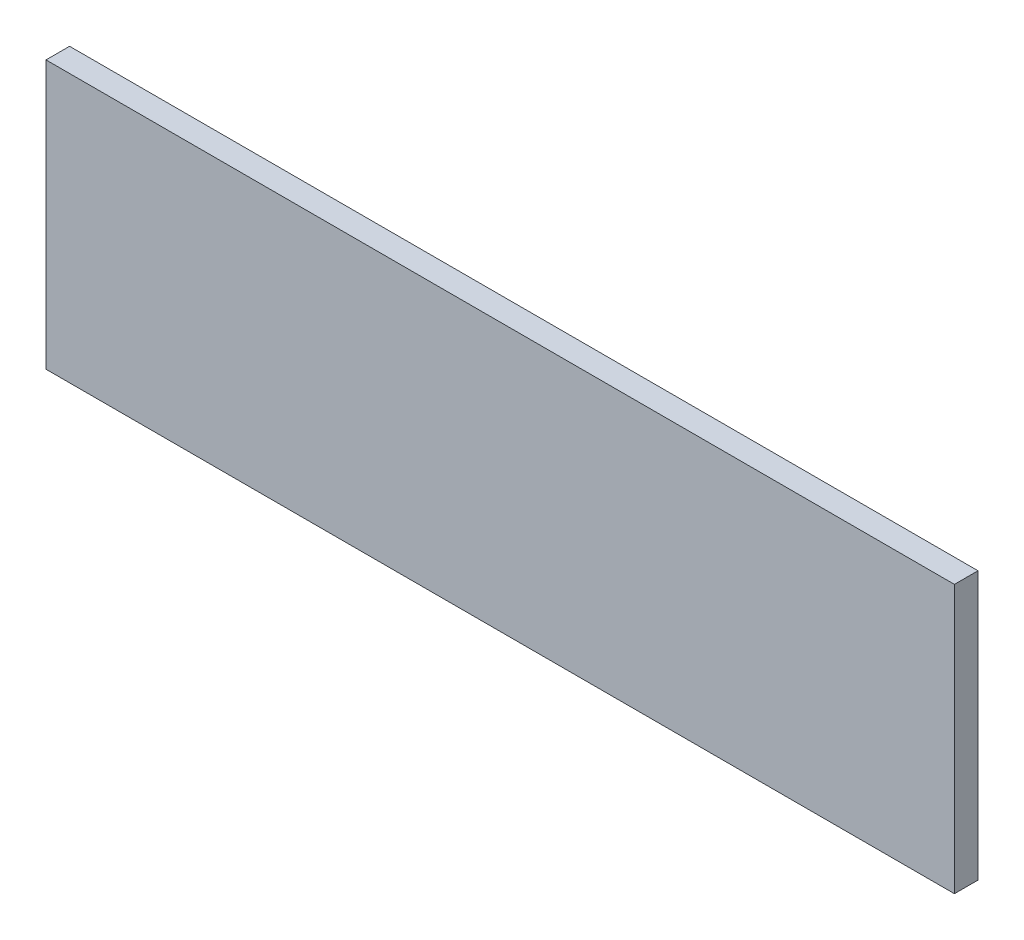
ISO-10303-21;
HEADER;
FILE_DESCRIPTION(('STEP AP214'),'2;1');
FILE_NAME('part.step','',(''),(''),'','','');
FILE_SCHEMA(('AUTOMOTIVE_DESIGN { 1 0 10303 214 1 1 1 1 }'));
ENDSEC;
DATA;
#1=APPLICATION_CONTEXT('core data for automotive mechanical design processes');
#2=APPLICATION_PROTOCOL_DEFINITION('international standard','automotive_design',2000,#1);
#3=PRODUCT_CONTEXT('',#1,'mechanical');
#4=PRODUCT('Part','Part','',(#3));
#5=PRODUCT_RELATED_PRODUCT_CATEGORY('part','',(#4));
#6=PRODUCT_DEFINITION_FORMATION('','',#4);
#7=PRODUCT_DEFINITION_CONTEXT('part definition',#1,'design');
#8=PRODUCT_DEFINITION('design','',#6,#7);
#9=PRODUCT_DEFINITION_SHAPE('','',#8);
#10=(LENGTH_UNIT() NAMED_UNIT(*) SI_UNIT(.MILLI.,.METRE.));
#11=(NAMED_UNIT(*) PLANE_ANGLE_UNIT() SI_UNIT($,.RADIAN.));
#12=(NAMED_UNIT(*) SI_UNIT($,.STERADIAN.) SOLID_ANGLE_UNIT());
#13=UNCERTAINTY_MEASURE_WITH_UNIT(LENGTH_MEASURE(1.E-05),#10,'distance_accuracy_value','');
#14=(GEOMETRIC_REPRESENTATION_CONTEXT(3) GLOBAL_UNCERTAINTY_ASSIGNED_CONTEXT((#13)) GLOBAL_UNIT_ASSIGNED_CONTEXT((#10,
#11,#12)) REPRESENTATION_CONTEXT('',''));
#15=CARTESIAN_POINT('',(0.,0.,0.));
#16=DIRECTION('',(0.,0.,1.));
#17=DIRECTION('',(1.,0.,0.));
#18=AXIS2_PLACEMENT_3D('',#15,#16,#17);
#19=CARTESIAN_POINT('',(2.11916772,-0.62500002,0.10999978));
#20=DIRECTION('',(0.,0.,1.));
#21=DIRECTION('',(1.,0.,0.));
#22=AXIS2_PLACEMENT_3D('',#19,#20,#21);
#23=PLANE('',#22);
#24=DIRECTION('',(0.,-1.,0.));
#25=VECTOR('',#24,1.);
#26=CARTESIAN_POINT('',(2.11916772,0.62500002,0.10999978));
#27=LINE('',#26,#25);
#28=CARTESIAN_POINT('',(2.11916772,0.62500002,0.10999978));
#29=VERTEX_POINT('',#28);
#30=CARTESIAN_POINT('',(2.11916772,-0.62500002,0.10999978));
#31=VERTEX_POINT('',#30);
#32=EDGE_CURVE('E28',#29,#31,#27,.T.);
#33=ORIENTED_EDGE('',*,*,#32,.F.);
#34=DIRECTION('',(1.,0.,0.));
#35=VECTOR('',#34,1.);
#36=CARTESIAN_POINT('',(-2.11916518,0.62500002,0.10999978));
#37=LINE('',#36,#35);
#38=CARTESIAN_POINT('',(-2.11916518,0.62500002,0.10999978));
#39=VERTEX_POINT('',#38);
#40=EDGE_CURVE('E21',#39,#29,#37,.T.);
#41=ORIENTED_EDGE('',*,*,#40,.F.);
#42=DIRECTION('',(0.,1.,0.));
#43=VECTOR('',#42,1.);
#44=CARTESIAN_POINT('',(-2.11916518,-0.62500002,0.10999978));
#45=LINE('',#44,#43);
#46=CARTESIAN_POINT('',(-2.11916518,-0.62500002,0.10999978));
#47=VERTEX_POINT('',#46);
#48=EDGE_CURVE('E59',#47,#39,#45,.T.);
#49=ORIENTED_EDGE('',*,*,#48,.F.);
#50=DIRECTION('',(-1.,0.,0.));
#51=VECTOR('',#50,1.);
#52=CARTESIAN_POINT('',(2.11916772,-0.62500002,0.10999978));
#53=LINE('',#52,#51);
#54=EDGE_CURVE('E111',#31,#47,#53,.T.);
#55=ORIENTED_EDGE('',*,*,#54,.F.);
#56=EDGE_LOOP('',(#33,#41,#49,#55));
#57=FACE_BOUND('',#56,.T.);
#58=ADVANCED_FACE('F17',(#57),#23,.T.);
#59=CARTESIAN_POINT('',(2.11916772,-0.62500002,0.));
#60=DIRECTION('',(0.,0.,1.));
#61=DIRECTION('',(1.,0.,0.));
#62=AXIS2_PLACEMENT_3D('',#59,#60,#61);
#63=PLANE('',#62);
#64=DIRECTION('',(-1.,0.,0.));
#65=VECTOR('',#64,1.);
#66=CARTESIAN_POINT('',(2.11916772,-0.62500002,0.));
#67=LINE('',#66,#65);
#68=CARTESIAN_POINT('',(2.11916772,-0.62500002,0.));
#69=VERTEX_POINT('',#68);
#70=CARTESIAN_POINT('',(-2.11916518,-0.62500002,0.));
#71=VERTEX_POINT('',#70);
#72=EDGE_CURVE('E89',#69,#71,#67,.T.);
#73=ORIENTED_EDGE('',*,*,#72,.T.);
#74=DIRECTION('',(0.,1.,0.));
#75=VECTOR('',#74,1.);
#76=CARTESIAN_POINT('',(-2.11916518,-0.62500002,0.));
#77=LINE('',#76,#75);
#78=CARTESIAN_POINT('',(-2.11916518,0.62500002,0.));
#79=VERTEX_POINT('',#78);
#80=EDGE_CURVE('E86',#71,#79,#77,.T.);
#81=ORIENTED_EDGE('',*,*,#80,.T.);
#82=DIRECTION('',(1.,0.,0.));
#83=VECTOR('',#82,1.);
#84=CARTESIAN_POINT('',(-2.11916518,0.62500002,0.));
#85=LINE('',#84,#83);
#86=CARTESIAN_POINT('',(2.11916772,0.62500002,0.));
#87=VERTEX_POINT('',#86);
#88=EDGE_CURVE('E75',#79,#87,#85,.T.);
#89=ORIENTED_EDGE('',*,*,#88,.T.);
#90=DIRECTION('',(0.,-1.,0.));
#91=VECTOR('',#90,1.);
#92=CARTESIAN_POINT('',(2.11916772,0.62500002,0.));
#93=LINE('',#92,#91);
#94=EDGE_CURVE('E11',#87,#69,#93,.T.);
#95=ORIENTED_EDGE('',*,*,#94,.T.);
#96=EDGE_LOOP('',(#73,#81,#89,#95));
#97=FACE_BOUND('',#96,.T.);
#98=ADVANCED_FACE('F87',(#97),#63,.F.);
#99=CARTESIAN_POINT('',(2.11916772,0.62500002,0.));
#100=DIRECTION('',(1.,0.,0.));
#101=DIRECTION('',(0.,1.,0.));
#102=AXIS2_PLACEMENT_3D('',#99,#100,#101);
#103=PLANE('',#102);
#104=DIRECTION('',(0.,0.,1.));
#105=VECTOR('',#104,1.);
#106=CARTESIAN_POINT('',(2.11916772,0.62500002,0.));
#107=LINE('',#106,#105);
#108=EDGE_CURVE('E81',#87,#29,#107,.T.);
#109=ORIENTED_EDGE('',*,*,#108,.T.);
#110=ORIENTED_EDGE('',*,*,#32,.T.);
#111=DIRECTION('',(0.,0.,1.));
#112=VECTOR('',#111,1.);
#113=CARTESIAN_POINT('',(2.11916772,-0.62500002,0.));
#114=LINE('',#113,#112);
#115=EDGE_CURVE('E103',#69,#31,#114,.T.);
#116=ORIENTED_EDGE('',*,*,#115,.F.);
#117=ORIENTED_EDGE('',*,*,#94,.F.);
#118=EDGE_LOOP('',(#109,#110,#116,#117));
#119=FACE_BOUND('',#118,.T.);
#120=ADVANCED_FACE('F130',(#119),#103,.T.);
#121=CARTESIAN_POINT('',(-2.11916518,0.62500002,0.));
#122=DIRECTION('',(0.,1.,0.));
#123=DIRECTION('',(1.,0.,0.));
#124=AXIS2_PLACEMENT_3D('',#121,#122,#123);
#125=PLANE('',#124);
#126=DIRECTION('',(0.,0.,1.));
#127=VECTOR('',#126,1.);
#128=CARTESIAN_POINT('',(-2.11916518,0.62500002,0.));
#129=LINE('',#128,#127);
#130=EDGE_CURVE('E80',#79,#39,#129,.T.);
#131=ORIENTED_EDGE('',*,*,#130,.T.);
#132=ORIENTED_EDGE('',*,*,#40,.T.);
#133=ORIENTED_EDGE('',*,*,#108,.F.);
#134=ORIENTED_EDGE('',*,*,#88,.F.);
#135=EDGE_LOOP('',(#131,#132,#133,#134));
#136=FACE_BOUND('',#135,.T.);
#137=ADVANCED_FACE('F77',(#136),#125,.T.);
#138=CARTESIAN_POINT('',(-2.11916518,-0.62500002,0.));
#139=DIRECTION('',(-1.,0.,0.));
#140=DIRECTION('',(0.,0.,1.));
#141=AXIS2_PLACEMENT_3D('',#138,#139,#140);
#142=PLANE('',#141);
#143=DIRECTION('',(0.,0.,1.));
#144=VECTOR('',#143,1.);
#145=CARTESIAN_POINT('',(-2.11916518,-0.62500002,0.));
#146=LINE('',#145,#144);
#147=EDGE_CURVE('E120',#71,#47,#146,.T.);
#148=ORIENTED_EDGE('',*,*,#147,.T.);
#149=ORIENTED_EDGE('',*,*,#48,.T.);
#150=ORIENTED_EDGE('',*,*,#130,.F.);
#151=ORIENTED_EDGE('',*,*,#80,.F.);
#152=EDGE_LOOP('',(#148,#149,#150,#151));
#153=FACE_BOUND('',#152,.T.);
#154=ADVANCED_FACE('F94',(#153),#142,.T.);
#155=CARTESIAN_POINT('',(2.11916772,-0.62500002,0.));
#156=DIRECTION('',(0.,-1.,0.));
#157=DIRECTION('',(0.,0.,-1.));
#158=AXIS2_PLACEMENT_3D('',#155,#156,#157);
#159=PLANE('',#158);
#160=ORIENTED_EDGE('',*,*,#115,.T.);
#161=ORIENTED_EDGE('',*,*,#54,.T.);
#162=ORIENTED_EDGE('',*,*,#147,.F.);
#163=ORIENTED_EDGE('',*,*,#72,.F.);
#164=EDGE_LOOP('',(#160,#161,#162,#163));
#165=FACE_BOUND('',#164,.T.);
#166=ADVANCED_FACE('F19',(#165),#159,.T.);
#167=CLOSED_SHELL('',(#58,#98,#120,#137,#154,#166));
#168=MANIFOLD_SOLID_BREP('B1',#167);
#169=ADVANCED_BREP_SHAPE_REPRESENTATION('',(#18,#168),#14);
#170=SHAPE_DEFINITION_REPRESENTATION(#9,#169);
ENDSEC;
END-ISO-10303-21;
